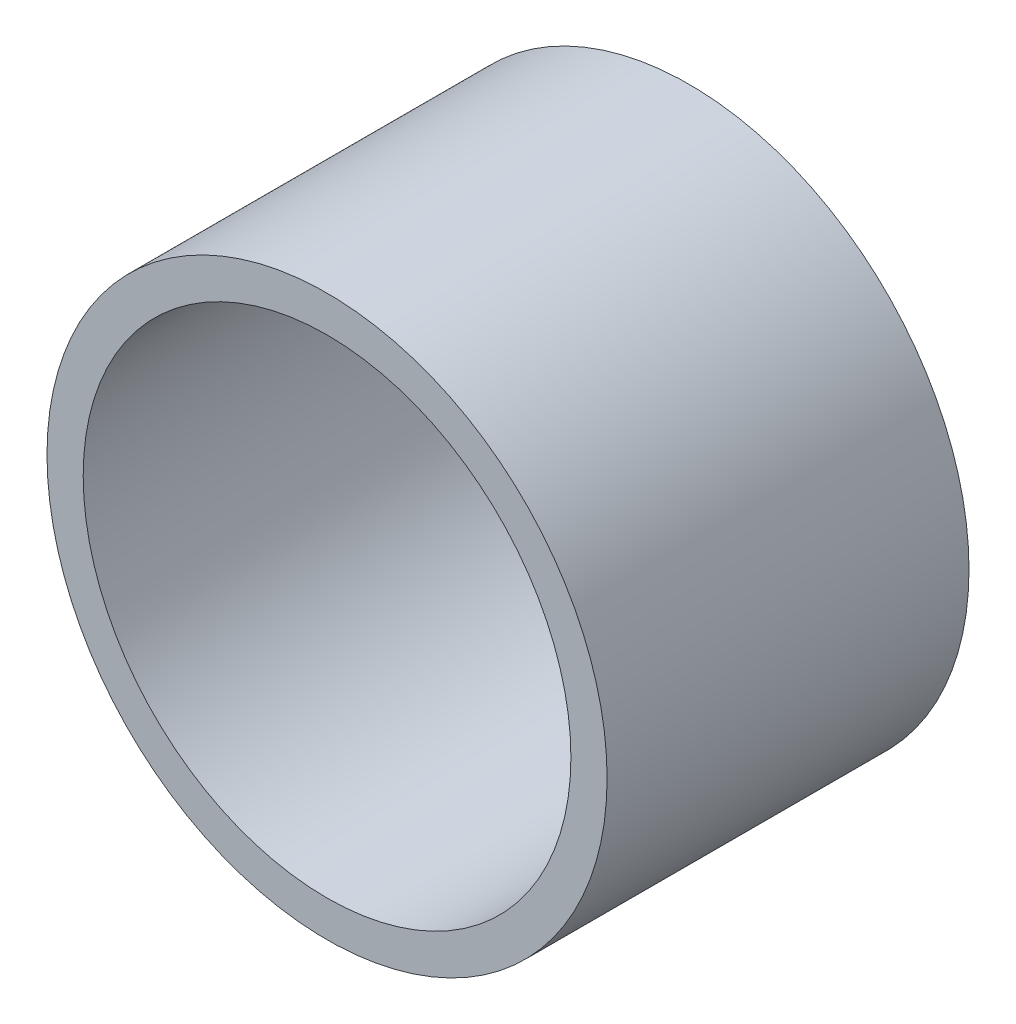
ISO-10303-21;
HEADER;
FILE_DESCRIPTION(('STEP AP214'),'2;1');
FILE_NAME('part.step','',(''),(''),'','','');
FILE_SCHEMA(('AUTOMOTIVE_DESIGN { 1 0 10303 214 1 1 1 1 }'));
ENDSEC;
DATA;
#1=APPLICATION_CONTEXT('core data for automotive mechanical design processes');
#2=APPLICATION_PROTOCOL_DEFINITION('international standard','automotive_design',2000,#1);
#3=PRODUCT_CONTEXT('',#1,'mechanical');
#4=PRODUCT('Part','Part','',(#3));
#5=PRODUCT_RELATED_PRODUCT_CATEGORY('part','',(#4));
#6=PRODUCT_DEFINITION_FORMATION('','',#4);
#7=PRODUCT_DEFINITION_CONTEXT('part definition',#1,'design');
#8=PRODUCT_DEFINITION('design','',#6,#7);
#9=PRODUCT_DEFINITION_SHAPE('','',#8);
#10=(LENGTH_UNIT() NAMED_UNIT(*) SI_UNIT(.MILLI.,.METRE.));
#11=(NAMED_UNIT(*) PLANE_ANGLE_UNIT() SI_UNIT($,.RADIAN.));
#12=(NAMED_UNIT(*) SI_UNIT($,.STERADIAN.) SOLID_ANGLE_UNIT());
#13=UNCERTAINTY_MEASURE_WITH_UNIT(LENGTH_MEASURE(1.E-05),#10,'distance_accuracy_value','');
#14=(GEOMETRIC_REPRESENTATION_CONTEXT(3) GLOBAL_UNCERTAINTY_ASSIGNED_CONTEXT((#13)) GLOBAL_UNIT_ASSIGNED_CONTEXT((#10,
#11,#12)) REPRESENTATION_CONTEXT('',''));
#15=CARTESIAN_POINT('',(0.,0.,0.));
#16=DIRECTION('',(0.,0.,1.));
#17=DIRECTION('',(1.,0.,0.));
#18=AXIS2_PLACEMENT_3D('',#15,#16,#17);
#19=CARTESIAN_POINT('',(0.,0.,12.7));
#20=DIRECTION('',(0.,0.,1.));
#21=DIRECTION('',(1.,0.,0.));
#22=AXIS2_PLACEMENT_3D('',#19,#20,#21);
#23=PLANE('',#22);
#24=CARTESIAN_POINT('',(0.,0.,12.7));
#25=DIRECTION('',(0.,0.,1.));
#26=DIRECTION('',(1.,0.,0.));
#27=AXIS2_PLACEMENT_3D('',#24,#25,#26);
#28=CIRCLE('',#27,9.82747979292244);
#29=CARTESIAN_POINT('',(9.82747979292244,0.,12.7));
#30=VERTEX_POINT('',#29);
#31=EDGE_CURVE('E12',#30,#30,#28,.T.);
#32=ORIENTED_EDGE('',*,*,#31,.T.);
#33=EDGE_LOOP('',(#32));
#34=FACE_BOUND('',#33,.T.);
#35=CARTESIAN_POINT('',(0.,0.,12.7));
#36=DIRECTION('',(0.,0.,1.));
#37=DIRECTION('',(1.,0.,0.));
#38=AXIS2_PLACEMENT_3D('',#35,#36,#37);
#39=CIRCLE('',#38,8.55747979292244);
#40=CARTESIAN_POINT('',(8.55747979292244,0.,12.7));
#41=VERTEX_POINT('',#40);
#42=EDGE_CURVE('E53',#41,#41,#39,.T.);
#43=ORIENTED_EDGE('',*,*,#42,.F.);
#44=EDGE_LOOP('',(#43));
#45=FACE_BOUND('',#44,.T.);
#46=ADVANCED_FACE('F42',(#34,#45),#23,.T.);
#47=CARTESIAN_POINT('',(0.,0.,0.));
#48=DIRECTION('',(0.,0.,1.));
#49=DIRECTION('',(1.,0.,0.));
#50=AXIS2_PLACEMENT_3D('',#47,#48,#49);
#51=PLANE('',#50);
#52=CARTESIAN_POINT('',(0.,0.,0.));
#53=DIRECTION('',(0.,0.,1.));
#54=DIRECTION('',(1.,0.,0.));
#55=AXIS2_PLACEMENT_3D('',#52,#53,#54);
#56=CIRCLE('',#55,9.82747979292244);
#57=CARTESIAN_POINT('',(9.82747979292244,0.,0.));
#58=VERTEX_POINT('',#57);
#59=EDGE_CURVE('E46',#58,#58,#56,.T.);
#60=ORIENTED_EDGE('',*,*,#59,.F.);
#61=EDGE_LOOP('',(#60));
#62=FACE_BOUND('',#61,.T.);
#63=CARTESIAN_POINT('',(0.,0.,0.));
#64=DIRECTION('',(0.,0.,1.));
#65=DIRECTION('',(1.,0.,0.));
#66=AXIS2_PLACEMENT_3D('',#63,#64,#65);
#67=CIRCLE('',#66,8.55747979292244);
#68=CARTESIAN_POINT('',(8.55747979292244,0.,0.));
#69=VERTEX_POINT('',#68);
#70=EDGE_CURVE('E55',#69,#69,#67,.T.);
#71=ORIENTED_EDGE('',*,*,#70,.T.);
#72=EDGE_LOOP('',(#71));
#73=FACE_BOUND('',#72,.T.);
#74=ADVANCED_FACE('F65',(#62,#73),#51,.F.);
#75=CARTESIAN_POINT('',(0.,0.,12.7));
#76=DIRECTION('',(0.,0.,-1.));
#77=DIRECTION('',(-1.,0.,0.));
#78=AXIS2_PLACEMENT_3D('',#75,#76,#77);
#79=CYLINDRICAL_SURFACE('',#78,9.82747979292244);
#80=ORIENTED_EDGE('',*,*,#31,.F.);
#81=EDGE_LOOP('',(#80));
#82=FACE_BOUND('',#81,.T.);
#83=ORIENTED_EDGE('',*,*,#59,.T.);
#84=EDGE_LOOP('',(#83));
#85=FACE_BOUND('',#84,.T.);
#86=ADVANCED_FACE('F44',(#82,#85),#79,.T.);
#87=CARTESIAN_POINT('',(0.,0.,12.7));
#88=DIRECTION('',(0.,0.,-1.));
#89=DIRECTION('',(-1.,0.,0.));
#90=AXIS2_PLACEMENT_3D('',#87,#88,#89);
#91=CYLINDRICAL_SURFACE('',#90,8.55747979292244);
#92=ORIENTED_EDGE('',*,*,#42,.T.);
#93=EDGE_LOOP('',(#92));
#94=FACE_BOUND('',#93,.T.);
#95=ORIENTED_EDGE('',*,*,#70,.F.);
#96=EDGE_LOOP('',(#95));
#97=FACE_BOUND('',#96,.T.);
#98=ADVANCED_FACE('F61',(#94,#97),#91,.F.);
#99=CLOSED_SHELL('',(#46,#74,#86,#98));
#100=MANIFOLD_SOLID_BREP('B2',#99);
#101=ADVANCED_BREP_SHAPE_REPRESENTATION('',(#18,#100),#14);
#102=SHAPE_DEFINITION_REPRESENTATION(#9,#101);
ENDSEC;
END-ISO-10303-21;
